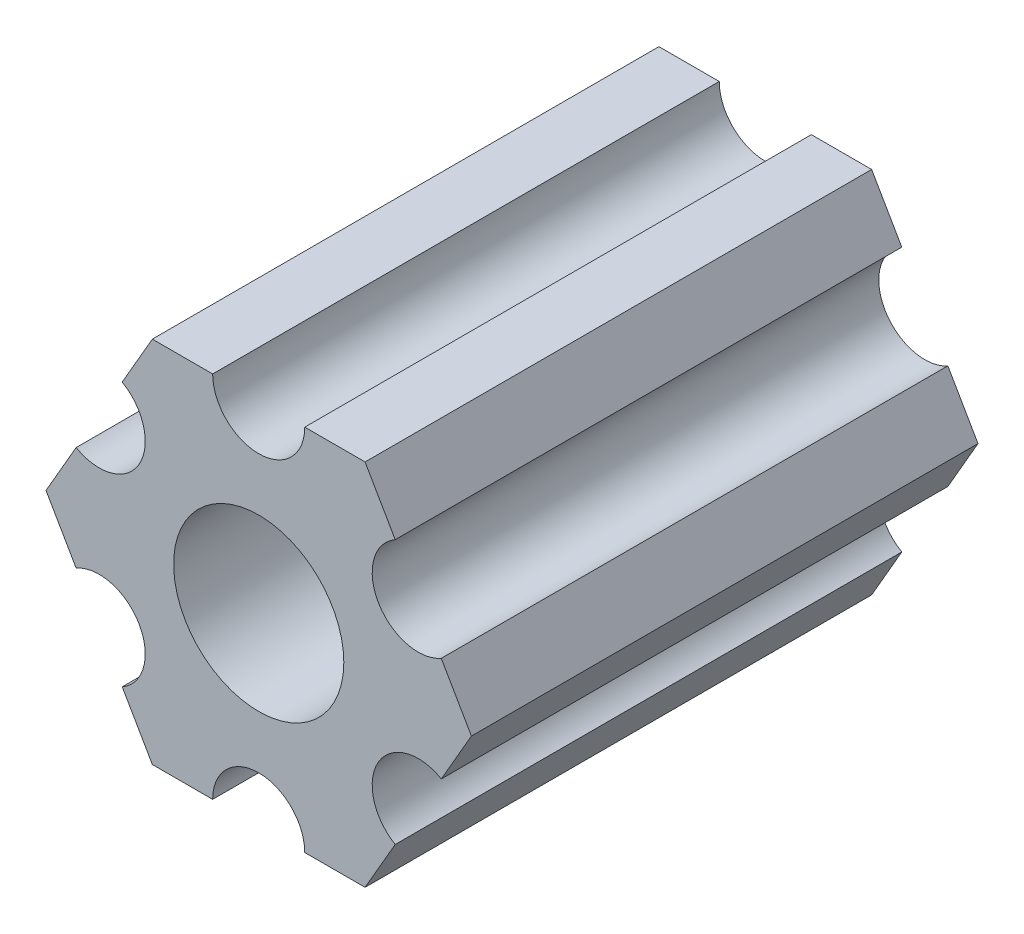
ISO-10303-21;
HEADER;
FILE_DESCRIPTION(('STEP AP214'),'2;1');
FILE_NAME('part.step','',(''),(''),'','','');
FILE_SCHEMA(('AUTOMOTIVE_DESIGN { 1 0 10303 214 1 1 1 1 }'));
ENDSEC;
DATA;
#1=APPLICATION_CONTEXT('core data for automotive mechanical design processes');
#2=APPLICATION_PROTOCOL_DEFINITION('international standard','automotive_design',2000,#1);
#3=PRODUCT_CONTEXT('',#1,'mechanical');
#4=PRODUCT('Part','Part','',(#3));
#5=PRODUCT_RELATED_PRODUCT_CATEGORY('part','',(#4));
#6=PRODUCT_DEFINITION_FORMATION('','',#4);
#7=PRODUCT_DEFINITION_CONTEXT('part definition',#1,'design');
#8=PRODUCT_DEFINITION('design','',#6,#7);
#9=PRODUCT_DEFINITION_SHAPE('','',#8);
#10=(LENGTH_UNIT() NAMED_UNIT(*) SI_UNIT(.MILLI.,.METRE.));
#11=(NAMED_UNIT(*) PLANE_ANGLE_UNIT() SI_UNIT($,.RADIAN.));
#12=(NAMED_UNIT(*) SI_UNIT($,.STERADIAN.) SOLID_ANGLE_UNIT());
#13=UNCERTAINTY_MEASURE_WITH_UNIT(LENGTH_MEASURE(1.E-05),#10,'distance_accuracy_value','');
#14=(GEOMETRIC_REPRESENTATION_CONTEXT(3) GLOBAL_UNCERTAINTY_ASSIGNED_CONTEXT((#13)) GLOBAL_UNIT_ASSIGNED_CONTEXT((#10,
#11,#12)) REPRESENTATION_CONTEXT('',''));
#15=CARTESIAN_POINT('',(0.,0.,0.));
#16=DIRECTION('',(0.,0.,1.));
#17=DIRECTION('',(1.,0.,0.));
#18=AXIS2_PLACEMENT_3D('',#15,#16,#17);
#19=CARTESIAN_POINT('',(5.49926123384919,-3.17500007340606,17.4625));
#20=DIRECTION('',(0.,0.,-1.));
#21=DIRECTION('',(-1.,0.,0.));
#22=AXIS2_PLACEMENT_3D('',#19,#20,#21);
#23=CYLINDRICAL_SURFACE('',#22,1.58750000000001);
#24=CARTESIAN_POINT('',(5.49926123384919,-3.17500007340606,0.));
#25=DIRECTION('',(0.,0.,1.));
#26=DIRECTION('',(1.,0.,0.));
#27=AXIS2_PLACEMENT_3D('',#24,#25,#26);
#28=CIRCLE('',#27,1.58750000000001);
#29=CARTESIAN_POINT('',(6.29301118896201,-1.80018471898264,0.));
#30=VERTEX_POINT('',#29);
#31=CARTESIAN_POINT('',(4.70551127873637,-4.54981542782949,0.));
#32=VERTEX_POINT('',#31);
#33=EDGE_CURVE('E190',#30,#32,#28,.T.);
#34=ORIENTED_EDGE('',*,*,#33,.F.);
#35=DIRECTION('',(0.,0.,-1.));
#36=VECTOR('',#35,1.);
#37=CARTESIAN_POINT('',(6.29301118896201,-1.80018471898264,17.4625));
#38=LINE('',#37,#36);
#39=CARTESIAN_POINT('',(6.29301118896201,-1.80018471898264,17.4625));
#40=VERTEX_POINT('',#39);
#41=EDGE_CURVE('E11',#40,#30,#38,.T.);
#42=ORIENTED_EDGE('',*,*,#41,.F.);
#43=CARTESIAN_POINT('',(5.49926123384919,-3.17500007340606,17.4625));
#44=DIRECTION('',(0.,0.,1.));
#45=DIRECTION('',(1.,0.,0.));
#46=AXIS2_PLACEMENT_3D('',#43,#44,#45);
#47=CIRCLE('',#46,1.58750000000001);
#48=CARTESIAN_POINT('',(4.70551127873637,-4.54981542782949,17.4625));
#49=VERTEX_POINT('',#48);
#50=EDGE_CURVE('E241',#40,#49,#47,.T.);
#51=ORIENTED_EDGE('',*,*,#50,.T.);
#52=DIRECTION('',(0.,0.,-1.));
#53=VECTOR('',#52,1.);
#54=CARTESIAN_POINT('',(4.70551127873637,-4.54981542782949,17.4625));
#55=LINE('',#54,#53);
#56=EDGE_CURVE('E36',#49,#32,#55,.T.);
#57=ORIENTED_EDGE('',*,*,#56,.T.);
#58=EDGE_LOOP('',(#34,#42,#51,#57));
#59=FACE_BOUND('',#58,.T.);
#60=ADVANCED_FACE('F33',(#59),#23,.F.);
#61=CARTESIAN_POINT('',(7.33234824269059,0.,17.4625));
#62=DIRECTION('',(0.866025420109243,-0.499999971724609,0.));
#63=DIRECTION('',(0.499999971724609,0.866025420109243,0.));
#64=AXIS2_PLACEMENT_3D('',#61,#62,#63);
#65=PLANE('',#64);
#66=DIRECTION('',(-0.499999971724609,-0.866025420109243,0.));
#67=VECTOR('',#66,1.);
#68=CARTESIAN_POINT('',(7.33234824269059,0.,0.));
#69=LINE('',#68,#67);
#70=CARTESIAN_POINT('',(7.33234824269059,0.,0.));
#71=VERTEX_POINT('',#70);
#72=EDGE_CURVE('E239',#71,#30,#69,.T.);
#73=ORIENTED_EDGE('',*,*,#72,.F.);
#74=DIRECTION('',(0.,0.,-1.));
#75=VECTOR('',#74,1.);
#76=CARTESIAN_POINT('',(7.33234824269059,0.,17.4625));
#77=LINE('',#76,#75);
#78=CARTESIAN_POINT('',(7.33234824269059,0.,17.4625));
#79=VERTEX_POINT('',#78);
#80=EDGE_CURVE('E42',#79,#71,#77,.T.);
#81=ORIENTED_EDGE('',*,*,#80,.F.);
#82=DIRECTION('',(-0.499999971724609,-0.866025420109243,0.));
#83=VECTOR('',#82,1.);
#84=CARTESIAN_POINT('',(7.33234824269059,0.,17.4625));
#85=LINE('',#84,#83);
#86=EDGE_CURVE('E180',#79,#40,#85,.T.);
#87=ORIENTED_EDGE('',*,*,#86,.T.);
#88=ORIENTED_EDGE('',*,*,#41,.T.);
#89=EDGE_LOOP('',(#73,#81,#87,#88));
#90=FACE_BOUND('',#89,.T.);
#91=ADVANCED_FACE('F273',(#90),#65,.T.);
#92=CARTESIAN_POINT('',(6.29301118896201,1.80018471898263,17.4625));
#93=DIRECTION('',(0.866025420109242,0.49999997172461,0.));
#94=DIRECTION('',(-0.49999997172461,0.866025420109242,0.));
#95=AXIS2_PLACEMENT_3D('',#92,#93,#94);
#96=PLANE('',#95);
#97=DIRECTION('',(0.49999997172461,-0.866025420109242,0.));
#98=VECTOR('',#97,1.);
#99=CARTESIAN_POINT('',(6.29301118896201,1.80018471898263,0.));
#100=LINE('',#99,#98);
#101=CARTESIAN_POINT('',(6.29301118896201,1.80018471898263,0.));
#102=VERTEX_POINT('',#101);
#103=EDGE_CURVE('E167',#102,#71,#100,.T.);
#104=ORIENTED_EDGE('',*,*,#103,.F.);
#105=DIRECTION('',(0.,0.,-1.));
#106=VECTOR('',#105,1.);
#107=CARTESIAN_POINT('',(6.29301118896201,1.80018471898263,17.4625));
#108=LINE('',#107,#106);
#109=CARTESIAN_POINT('',(6.29301118896201,1.80018471898263,17.4625));
#110=VERTEX_POINT('',#109);
#111=EDGE_CURVE('E162',#110,#102,#108,.T.);
#112=ORIENTED_EDGE('',*,*,#111,.F.);
#113=DIRECTION('',(0.49999997172461,-0.866025420109242,0.));
#114=VECTOR('',#113,1.);
#115=CARTESIAN_POINT('',(6.29301118896201,1.80018471898263,17.4625));
#116=LINE('',#115,#114);
#117=EDGE_CURVE('E165',#110,#79,#116,.T.);
#118=ORIENTED_EDGE('',*,*,#117,.T.);
#119=ORIENTED_EDGE('',*,*,#80,.T.);
#120=EDGE_LOOP('',(#104,#112,#118,#119));
#121=FACE_BOUND('',#120,.T.);
#122=ADVANCED_FACE('F164',(#121),#96,.T.);
#123=CARTESIAN_POINT('',(5.49926123384919,3.17500007340606,17.4625));
#124=DIRECTION('',(0.,0.,-1.));
#125=DIRECTION('',(-1.,0.,0.));
#126=AXIS2_PLACEMENT_3D('',#123,#124,#125);
#127=CYLINDRICAL_SURFACE('',#126,1.5875);
#128=CARTESIAN_POINT('',(5.49926123384919,3.17500007340606,0.));
#129=DIRECTION('',(0.,0.,1.));
#130=DIRECTION('',(1.,0.,0.));
#131=AXIS2_PLACEMENT_3D('',#128,#129,#130);
#132=CIRCLE('',#131,1.5875);
#133=CARTESIAN_POINT('',(4.70551127873637,4.54981542782948,0.));
#134=VERTEX_POINT('',#133);
#135=EDGE_CURVE('E236',#134,#102,#132,.T.);
#136=ORIENTED_EDGE('',*,*,#135,.F.);
#137=DIRECTION('',(0.,0.,-1.));
#138=VECTOR('',#137,1.);
#139=CARTESIAN_POINT('',(4.70551127873637,4.54981542782948,17.4625));
#140=LINE('',#139,#138);
#141=CARTESIAN_POINT('',(4.70551127873637,4.54981542782948,17.4625));
#142=VERTEX_POINT('',#141);
#143=EDGE_CURVE('E172',#142,#134,#140,.T.);
#144=ORIENTED_EDGE('',*,*,#143,.F.);
#145=CARTESIAN_POINT('',(5.49926123384919,3.17500007340606,17.4625));
#146=DIRECTION('',(0.,0.,1.));
#147=DIRECTION('',(1.,0.,0.));
#148=AXIS2_PLACEMENT_3D('',#145,#146,#147);
#149=CIRCLE('',#148,1.5875);
#150=EDGE_CURVE('E178',#142,#110,#149,.T.);
#151=ORIENTED_EDGE('',*,*,#150,.T.);
#152=ORIENTED_EDGE('',*,*,#111,.T.);
#153=EDGE_LOOP('',(#136,#144,#151,#152));
#154=FACE_BOUND('',#153,.T.);
#155=ADVANCED_FACE('F182',(#154),#127,.F.);
#156=CARTESIAN_POINT('',(3.6661742250078,6.35000014681211,17.4625));
#157=DIRECTION('',(0.866025420109242,0.49999997172461,0.));
#158=DIRECTION('',(-0.49999997172461,0.866025420109242,0.));
#159=AXIS2_PLACEMENT_3D('',#156,#157,#158);
#160=PLANE('',#159);
#161=DIRECTION('',(0.49999997172461,-0.866025420109242,0.));
#162=VECTOR('',#161,1.);
#163=CARTESIAN_POINT('',(3.6661742250078,6.35000014681211,0.));
#164=LINE('',#163,#162);
#165=CARTESIAN_POINT('',(3.6661742250078,6.35000014681211,0.));
#166=VERTEX_POINT('',#165);
#167=EDGE_CURVE('E233',#166,#134,#164,.T.);
#168=ORIENTED_EDGE('',*,*,#167,.F.);
#169=DIRECTION('',(0.,0.,-1.));
#170=VECTOR('',#169,1.);
#171=CARTESIAN_POINT('',(3.6661742250078,6.35000014681211,17.4625));
#172=LINE('',#171,#170);
#173=CARTESIAN_POINT('',(3.6661742250078,6.35000014681211,17.4625));
#174=VERTEX_POINT('',#173);
#175=EDGE_CURVE('E245',#174,#166,#172,.T.);
#176=ORIENTED_EDGE('',*,*,#175,.F.);
#177=DIRECTION('',(0.49999997172461,-0.866025420109242,0.));
#178=VECTOR('',#177,1.);
#179=CARTESIAN_POINT('',(3.6661742250078,6.35000014681211,17.4625));
#180=LINE('',#179,#178);
#181=EDGE_CURVE('E183',#174,#142,#180,.T.);
#182=ORIENTED_EDGE('',*,*,#181,.T.);
#183=ORIENTED_EDGE('',*,*,#143,.T.);
#184=EDGE_LOOP('',(#168,#176,#182,#183));
#185=FACE_BOUND('',#184,.T.);
#186=ADVANCED_FACE('F286',(#185),#160,.T.);
#187=CARTESIAN_POINT('',(1.5875,6.35000014681211,17.4625));
#188=DIRECTION('',(0.,1.,0.));
#189=DIRECTION('',(0.,0.,1.));
#190=AXIS2_PLACEMENT_3D('',#187,#188,#189);
#191=PLANE('',#190);
#192=DIRECTION('',(1.,0.,0.));
#193=VECTOR('',#192,1.);
#194=CARTESIAN_POINT('',(1.5875,6.35000014681211,0.));
#195=LINE('',#194,#193);
#196=CARTESIAN_POINT('',(1.5875,6.35000014681211,0.));
#197=VERTEX_POINT('',#196);
#198=EDGE_CURVE('E230',#197,#166,#195,.T.);
#199=ORIENTED_EDGE('',*,*,#198,.F.);
#200=DIRECTION('',(0.,0.,-1.));
#201=VECTOR('',#200,1.);
#202=CARTESIAN_POINT('',(1.5875,6.35000014681211,17.4625));
#203=LINE('',#202,#201);
#204=CARTESIAN_POINT('',(1.5875,6.35000014681211,17.4625));
#205=VERTEX_POINT('',#204);
#206=EDGE_CURVE('E247',#205,#197,#203,.T.);
#207=ORIENTED_EDGE('',*,*,#206,.F.);
#208=DIRECTION('',(1.,0.,0.));
#209=VECTOR('',#208,1.);
#210=CARTESIAN_POINT('',(1.5875,6.35000014681211,17.4625));
#211=LINE('',#210,#209);
#212=EDGE_CURVE('E185',#205,#174,#211,.T.);
#213=ORIENTED_EDGE('',*,*,#212,.T.);
#214=ORIENTED_EDGE('',*,*,#175,.T.);
#215=EDGE_LOOP('',(#199,#207,#213,#214));
#216=FACE_BOUND('',#215,.T.);
#217=ADVANCED_FACE('F289',(#216),#191,.T.);
#218=CARTESIAN_POINT('',(0.,6.35000014681211,17.4625));
#219=DIRECTION('',(0.,0.,-1.));
#220=DIRECTION('',(-1.,0.,0.));
#221=AXIS2_PLACEMENT_3D('',#218,#219,#220);
#222=CYLINDRICAL_SURFACE('',#221,1.5875);
#223=CARTESIAN_POINT('',(0.,6.35000014681211,0.));
#224=DIRECTION('',(0.,0.,1.));
#225=DIRECTION('',(1.,0.,0.));
#226=AXIS2_PLACEMENT_3D('',#223,#224,#225);
#227=CIRCLE('',#226,1.5875);
#228=CARTESIAN_POINT('',(-1.5875,6.35000014681211,0.));
#229=VERTEX_POINT('',#228);
#230=EDGE_CURVE('E227',#229,#197,#227,.T.);
#231=ORIENTED_EDGE('',*,*,#230,.F.);
#232=DIRECTION('',(0.,0.,-1.));
#233=VECTOR('',#232,1.);
#234=CARTESIAN_POINT('',(-1.5875,6.35000014681211,17.4625));
#235=LINE('',#234,#233);
#236=CARTESIAN_POINT('',(-1.5875,6.35000014681211,17.4625));
#237=VERTEX_POINT('',#236);
#238=EDGE_CURVE('E249',#237,#229,#235,.T.);
#239=ORIENTED_EDGE('',*,*,#238,.F.);
#240=CARTESIAN_POINT('',(0.,6.35000014681211,17.4625));
#241=DIRECTION('',(0.,0.,1.));
#242=DIRECTION('',(1.,0.,0.));
#243=AXIS2_PLACEMENT_3D('',#240,#241,#242);
#244=CIRCLE('',#243,1.5875);
#245=EDGE_CURVE('E394',#237,#205,#244,.T.);
#246=ORIENTED_EDGE('',*,*,#245,.T.);
#247=ORIENTED_EDGE('',*,*,#206,.T.);
#248=EDGE_LOOP('',(#231,#239,#246,#247));
#249=FACE_BOUND('',#248,.T.);
#250=ADVANCED_FACE('F293',(#249),#222,.F.);
#251=CARTESIAN_POINT('',(-3.6661742250078,6.35000014681211,17.4625));
#252=DIRECTION('',(0.,1.,0.));
#253=DIRECTION('',(0.,0.,1.));
#254=AXIS2_PLACEMENT_3D('',#251,#252,#253);
#255=PLANE('',#254);
#256=DIRECTION('',(1.,0.,0.));
#257=VECTOR('',#256,1.);
#258=CARTESIAN_POINT('',(-3.6661742250078,6.35000014681211,0.));
#259=LINE('',#258,#257);
#260=CARTESIAN_POINT('',(-3.6661742250078,6.35000014681211,0.));
#261=VERTEX_POINT('',#260);
#262=EDGE_CURVE('E224',#261,#229,#259,.T.);
#263=ORIENTED_EDGE('',*,*,#262,.F.);
#264=DIRECTION('',(0.,0.,-1.));
#265=VECTOR('',#264,1.);
#266=CARTESIAN_POINT('',(-3.6661742250078,6.35000014681211,17.4625));
#267=LINE('',#266,#265);
#268=CARTESIAN_POINT('',(-3.6661742250078,6.35000014681211,17.4625));
#269=VERTEX_POINT('',#268);
#270=EDGE_CURVE('E251',#269,#261,#267,.T.);
#271=ORIENTED_EDGE('',*,*,#270,.F.);
#272=DIRECTION('',(1.,0.,0.));
#273=VECTOR('',#272,1.);
#274=CARTESIAN_POINT('',(-3.6661742250078,6.35000014681211,17.4625));
#275=LINE('',#274,#273);
#276=EDGE_CURVE('E391',#269,#237,#275,.T.);
#277=ORIENTED_EDGE('',*,*,#276,.T.);
#278=ORIENTED_EDGE('',*,*,#238,.T.);
#279=EDGE_LOOP('',(#263,#271,#277,#278));
#280=FACE_BOUND('',#279,.T.);
#281=ADVANCED_FACE('F297',(#280),#255,.T.);
#282=CARTESIAN_POINT('',(-4.70551127873637,4.54981542782948,17.4625));
#283=DIRECTION('',(-0.866025420109242,0.49999997172461,0.));
#284=DIRECTION('',(-0.49999997172461,-0.866025420109242,0.));
#285=AXIS2_PLACEMENT_3D('',#282,#283,#284);
#286=PLANE('',#285);
#287=DIRECTION('',(0.49999997172461,0.866025420109242,0.));
#288=VECTOR('',#287,1.);
#289=CARTESIAN_POINT('',(-4.70551127873637,4.54981542782948,0.));
#290=LINE('',#289,#288);
#291=CARTESIAN_POINT('',(-4.70551127873637,4.54981542782948,0.));
#292=VERTEX_POINT('',#291);
#293=EDGE_CURVE('E221',#292,#261,#290,.T.);
#294=ORIENTED_EDGE('',*,*,#293,.F.);
#295=DIRECTION('',(0.,0.,-1.));
#296=VECTOR('',#295,1.);
#297=CARTESIAN_POINT('',(-4.70551127873637,4.54981542782948,17.4625));
#298=LINE('',#297,#296);
#299=CARTESIAN_POINT('',(-4.70551127873637,4.54981542782948,17.4625));
#300=VERTEX_POINT('',#299);
#301=EDGE_CURVE('E253',#300,#292,#298,.T.);
#302=ORIENTED_EDGE('',*,*,#301,.F.);
#303=DIRECTION('',(0.49999997172461,0.866025420109242,0.));
#304=VECTOR('',#303,1.);
#305=CARTESIAN_POINT('',(-4.70551127873637,4.54981542782948,17.4625));
#306=LINE('',#305,#304);
#307=EDGE_CURVE('E388',#300,#269,#306,.T.);
#308=ORIENTED_EDGE('',*,*,#307,.T.);
#309=ORIENTED_EDGE('',*,*,#270,.T.);
#310=EDGE_LOOP('',(#294,#302,#308,#309));
#311=FACE_BOUND('',#310,.T.);
#312=ADVANCED_FACE('F301',(#311),#286,.T.);
#313=CARTESIAN_POINT('',(-5.49926123384919,3.17500007340605,17.4625));
#314=DIRECTION('',(0.,0.,-1.));
#315=DIRECTION('',(-1.,0.,0.));
#316=AXIS2_PLACEMENT_3D('',#313,#314,#315);
#317=CYLINDRICAL_SURFACE('',#316,1.5875);
#318=CARTESIAN_POINT('',(-5.49926123384919,3.17500007340605,0.));
#319=DIRECTION('',(0.,0.,1.));
#320=DIRECTION('',(1.,0.,0.));
#321=AXIS2_PLACEMENT_3D('',#318,#319,#320);
#322=CIRCLE('',#321,1.5875);
#323=CARTESIAN_POINT('',(-6.29301118896201,1.80018471898263,0.));
#324=VERTEX_POINT('',#323);
#325=EDGE_CURVE('E218',#324,#292,#322,.T.);
#326=ORIENTED_EDGE('',*,*,#325,.F.);
#327=DIRECTION('',(0.,0.,-1.));
#328=VECTOR('',#327,1.);
#329=CARTESIAN_POINT('',(-6.29301118896201,1.80018471898263,17.4625));
#330=LINE('',#329,#328);
#331=CARTESIAN_POINT('',(-6.29301118896201,1.80018471898263,17.4625));
#332=VERTEX_POINT('',#331);
#333=EDGE_CURVE('E255',#332,#324,#330,.T.);
#334=ORIENTED_EDGE('',*,*,#333,.F.);
#335=CARTESIAN_POINT('',(-5.49926123384919,3.17500007340605,17.4625));
#336=DIRECTION('',(0.,0.,1.));
#337=DIRECTION('',(1.,0.,0.));
#338=AXIS2_PLACEMENT_3D('',#335,#336,#337);
#339=CIRCLE('',#338,1.5875);
#340=EDGE_CURVE('E385',#332,#300,#339,.T.);
#341=ORIENTED_EDGE('',*,*,#340,.T.);
#342=ORIENTED_EDGE('',*,*,#301,.T.);
#343=EDGE_LOOP('',(#326,#334,#341,#342));
#344=FACE_BOUND('',#343,.T.);
#345=ADVANCED_FACE('F305',(#344),#317,.F.);
#346=CARTESIAN_POINT('',(-7.33234824269059,0.,17.4625));
#347=DIRECTION('',(-0.866025420109242,0.49999997172461,0.));
#348=DIRECTION('',(-0.49999997172461,-0.866025420109242,0.));
#349=AXIS2_PLACEMENT_3D('',#346,#347,#348);
#350=PLANE('',#349);
#351=DIRECTION('',(0.49999997172461,0.866025420109242,0.));
#352=VECTOR('',#351,1.);
#353=CARTESIAN_POINT('',(-7.33234824269059,0.,0.));
#354=LINE('',#353,#352);
#355=CARTESIAN_POINT('',(-7.33234824269059,0.,0.));
#356=VERTEX_POINT('',#355);
#357=EDGE_CURVE('E215',#356,#324,#354,.T.);
#358=ORIENTED_EDGE('',*,*,#357,.F.);
#359=DIRECTION('',(0.,0.,-1.));
#360=VECTOR('',#359,1.);
#361=CARTESIAN_POINT('',(-7.33234824269059,0.,17.4625));
#362=LINE('',#361,#360);
#363=CARTESIAN_POINT('',(-7.33234824269059,0.,17.4625));
#364=VERTEX_POINT('',#363);
#365=EDGE_CURVE('E257',#364,#356,#362,.T.);
#366=ORIENTED_EDGE('',*,*,#365,.F.);
#367=DIRECTION('',(0.49999997172461,0.866025420109242,0.));
#368=VECTOR('',#367,1.);
#369=CARTESIAN_POINT('',(-7.33234824269059,0.,17.4625));
#370=LINE('',#369,#368);
#371=EDGE_CURVE('E382',#364,#332,#370,.T.);
#372=ORIENTED_EDGE('',*,*,#371,.T.);
#373=ORIENTED_EDGE('',*,*,#333,.T.);
#374=EDGE_LOOP('',(#358,#366,#372,#373));
#375=FACE_BOUND('',#374,.T.);
#376=ADVANCED_FACE('F309',(#375),#350,.T.);
#377=CARTESIAN_POINT('',(-6.29301118896201,-1.80018471898264,17.4625));
#378=DIRECTION('',(-0.866025420109243,-0.499999971724609,0.));
#379=DIRECTION('',(0.499999971724609,-0.866025420109243,0.));
#380=AXIS2_PLACEMENT_3D('',#377,#378,#379);
#381=PLANE('',#380);
#382=DIRECTION('',(-0.499999971724609,0.866025420109243,0.));
#383=VECTOR('',#382,1.);
#384=CARTESIAN_POINT('',(-6.29301118896201,-1.80018471898264,0.));
#385=LINE('',#384,#383);
#386=CARTESIAN_POINT('',(-6.29301118896201,-1.80018471898264,0.));
#387=VERTEX_POINT('',#386);
#388=EDGE_CURVE('E212',#387,#356,#385,.T.);
#389=ORIENTED_EDGE('',*,*,#388,.F.);
#390=DIRECTION('',(0.,0.,-1.));
#391=VECTOR('',#390,1.);
#392=CARTESIAN_POINT('',(-6.29301118896201,-1.80018471898264,17.4625));
#393=LINE('',#392,#391);
#394=CARTESIAN_POINT('',(-6.29301118896201,-1.80018471898264,17.4625));
#395=VERTEX_POINT('',#394);
#396=EDGE_CURVE('E259',#395,#387,#393,.T.);
#397=ORIENTED_EDGE('',*,*,#396,.F.);
#398=DIRECTION('',(-0.499999971724609,0.866025420109243,0.));
#399=VECTOR('',#398,1.);
#400=CARTESIAN_POINT('',(-6.29301118896201,-1.80018471898264,17.4625));
#401=LINE('',#400,#399);
#402=EDGE_CURVE('E379',#395,#364,#401,.T.);
#403=ORIENTED_EDGE('',*,*,#402,.T.);
#404=ORIENTED_EDGE('',*,*,#365,.T.);
#405=EDGE_LOOP('',(#389,#397,#403,#404));
#406=FACE_BOUND('',#405,.T.);
#407=ADVANCED_FACE('F313',(#406),#381,.T.);
#408=CARTESIAN_POINT('',(-5.49926123384919,-3.17500007340606,17.4625));
#409=DIRECTION('',(0.,0.,-1.));
#410=DIRECTION('',(-1.,0.,0.));
#411=AXIS2_PLACEMENT_3D('',#408,#409,#410);
#412=CYLINDRICAL_SURFACE('',#411,1.58750000000001);
#413=CARTESIAN_POINT('',(-5.49926123384919,-3.17500007340606,0.));
#414=DIRECTION('',(0.,0.,1.));
#415=DIRECTION('',(1.,0.,0.));
#416=AXIS2_PLACEMENT_3D('',#413,#414,#415);
#417=CIRCLE('',#416,1.58750000000001);
#418=CARTESIAN_POINT('',(-4.70551127873637,-4.54981542782949,0.));
#419=VERTEX_POINT('',#418);
#420=EDGE_CURVE('E209',#419,#387,#417,.T.);
#421=ORIENTED_EDGE('',*,*,#420,.F.);
#422=DIRECTION('',(0.,0.,-1.));
#423=VECTOR('',#422,1.);
#424=CARTESIAN_POINT('',(-4.70551127873637,-4.54981542782949,17.4625));
#425=LINE('',#424,#423);
#426=CARTESIAN_POINT('',(-4.70551127873637,-4.54981542782949,17.4625));
#427=VERTEX_POINT('',#426);
#428=EDGE_CURVE('E261',#427,#419,#425,.T.);
#429=ORIENTED_EDGE('',*,*,#428,.F.);
#430=CARTESIAN_POINT('',(-5.49926123384919,-3.17500007340606,17.4625));
#431=DIRECTION('',(0.,0.,1.));
#432=DIRECTION('',(1.,0.,0.));
#433=AXIS2_PLACEMENT_3D('',#430,#431,#432);
#434=CIRCLE('',#433,1.58750000000001);
#435=EDGE_CURVE('E376',#427,#395,#434,.T.);
#436=ORIENTED_EDGE('',*,*,#435,.T.);
#437=ORIENTED_EDGE('',*,*,#396,.T.);
#438=EDGE_LOOP('',(#421,#429,#436,#437));
#439=FACE_BOUND('',#438,.T.);
#440=ADVANCED_FACE('F317',(#439),#412,.F.);
#441=CARTESIAN_POINT('',(-3.6661742250078,-6.35000014681213,17.4625));
#442=DIRECTION('',(-0.866025420109243,-0.499999971724609,0.));
#443=DIRECTION('',(0.499999971724609,-0.866025420109243,0.));
#444=AXIS2_PLACEMENT_3D('',#441,#442,#443);
#445=PLANE('',#444);
#446=DIRECTION('',(-0.499999971724609,0.866025420109243,0.));
#447=VECTOR('',#446,1.);
#448=CARTESIAN_POINT('',(-3.6661742250078,-6.35000014681213,0.));
#449=LINE('',#448,#447);
#450=CARTESIAN_POINT('',(-3.6661742250078,-6.35000014681213,0.));
#451=VERTEX_POINT('',#450);
#452=EDGE_CURVE('E206',#451,#419,#449,.T.);
#453=ORIENTED_EDGE('',*,*,#452,.F.);
#454=DIRECTION('',(0.,0.,-1.));
#455=VECTOR('',#454,1.);
#456=CARTESIAN_POINT('',(-3.6661742250078,-6.35000014681213,17.4625));
#457=LINE('',#456,#455);
#458=CARTESIAN_POINT('',(-3.6661742250078,-6.35000014681213,17.4625));
#459=VERTEX_POINT('',#458);
#460=EDGE_CURVE('E263',#459,#451,#457,.T.);
#461=ORIENTED_EDGE('',*,*,#460,.F.);
#462=DIRECTION('',(-0.499999971724609,0.866025420109243,0.));
#463=VECTOR('',#462,1.);
#464=CARTESIAN_POINT('',(-3.6661742250078,-6.35000014681213,17.4625));
#465=LINE('',#464,#463);
#466=EDGE_CURVE('E373',#459,#427,#465,.T.);
#467=ORIENTED_EDGE('',*,*,#466,.T.);
#468=ORIENTED_EDGE('',*,*,#428,.T.);
#469=EDGE_LOOP('',(#453,#461,#467,#468));
#470=FACE_BOUND('',#469,.T.);
#471=ADVANCED_FACE('F321',(#470),#445,.T.);
#472=CARTESIAN_POINT('',(-1.5875,-6.35000014681213,17.4625));
#473=DIRECTION('',(0.,-1.,0.));
#474=DIRECTION('',(0.,0.,-1.));
#475=AXIS2_PLACEMENT_3D('',#472,#473,#474);
#476=PLANE('',#475);
#477=DIRECTION('',(-1.,0.,0.));
#478=VECTOR('',#477,1.);
#479=CARTESIAN_POINT('',(-1.5875,-6.35000014681213,0.));
#480=LINE('',#479,#478);
#481=CARTESIAN_POINT('',(-1.5875,-6.35000014681213,0.));
#482=VERTEX_POINT('',#481);
#483=EDGE_CURVE('E203',#482,#451,#480,.T.);
#484=ORIENTED_EDGE('',*,*,#483,.F.);
#485=DIRECTION('',(0.,0.,-1.));
#486=VECTOR('',#485,1.);
#487=CARTESIAN_POINT('',(-1.5875,-6.35000014681213,17.4625));
#488=LINE('',#487,#486);
#489=CARTESIAN_POINT('',(-1.5875,-6.35000014681213,17.4625));
#490=VERTEX_POINT('',#489);
#491=EDGE_CURVE('E265',#490,#482,#488,.T.);
#492=ORIENTED_EDGE('',*,*,#491,.F.);
#493=DIRECTION('',(-1.,0.,0.));
#494=VECTOR('',#493,1.);
#495=CARTESIAN_POINT('',(-1.5875,-6.35000014681213,17.4625));
#496=LINE('',#495,#494);
#497=EDGE_CURVE('E370',#490,#459,#496,.T.);
#498=ORIENTED_EDGE('',*,*,#497,.T.);
#499=ORIENTED_EDGE('',*,*,#460,.T.);
#500=EDGE_LOOP('',(#484,#492,#498,#499));
#501=FACE_BOUND('',#500,.T.);
#502=ADVANCED_FACE('F325',(#501),#476,.T.);
#503=CARTESIAN_POINT('',(0.,-6.35000014681213,17.4625));
#504=DIRECTION('',(0.,0.,-1.));
#505=DIRECTION('',(-1.,0.,0.));
#506=AXIS2_PLACEMENT_3D('',#503,#504,#505);
#507=CYLINDRICAL_SURFACE('',#506,1.5875);
#508=CARTESIAN_POINT('',(0.,-6.35000014681213,0.));
#509=DIRECTION('',(0.,0.,1.));
#510=DIRECTION('',(1.,0.,0.));
#511=AXIS2_PLACEMENT_3D('',#508,#509,#510);
#512=CIRCLE('',#511,1.5875);
#513=CARTESIAN_POINT('',(1.5875,-6.35000014681213,0.));
#514=VERTEX_POINT('',#513);
#515=EDGE_CURVE('E200',#514,#482,#512,.T.);
#516=ORIENTED_EDGE('',*,*,#515,.F.);
#517=DIRECTION('',(0.,0.,-1.));
#518=VECTOR('',#517,1.);
#519=CARTESIAN_POINT('',(1.5875,-6.35000014681213,17.4625));
#520=LINE('',#519,#518);
#521=CARTESIAN_POINT('',(1.5875,-6.35000014681213,17.4625));
#522=VERTEX_POINT('',#521);
#523=EDGE_CURVE('E267',#522,#514,#520,.T.);
#524=ORIENTED_EDGE('',*,*,#523,.F.);
#525=CARTESIAN_POINT('',(0.,-6.35000014681213,17.4625));
#526=DIRECTION('',(0.,0.,1.));
#527=DIRECTION('',(1.,0.,0.));
#528=AXIS2_PLACEMENT_3D('',#525,#526,#527);
#529=CIRCLE('',#528,1.5875);
#530=EDGE_CURVE('E367',#522,#490,#529,.T.);
#531=ORIENTED_EDGE('',*,*,#530,.T.);
#532=ORIENTED_EDGE('',*,*,#491,.T.);
#533=EDGE_LOOP('',(#516,#524,#531,#532));
#534=FACE_BOUND('',#533,.T.);
#535=ADVANCED_FACE('F329',(#534),#507,.F.);
#536=CARTESIAN_POINT('',(3.6661742250078,-6.35000014681213,17.4625));
#537=DIRECTION('',(0.,-1.,0.));
#538=DIRECTION('',(0.,0.,-1.));
#539=AXIS2_PLACEMENT_3D('',#536,#537,#538);
#540=PLANE('',#539);
#541=DIRECTION('',(-1.,0.,0.));
#542=VECTOR('',#541,1.);
#543=CARTESIAN_POINT('',(3.6661742250078,-6.35000014681213,0.));
#544=LINE('',#543,#542);
#545=CARTESIAN_POINT('',(3.6661742250078,-6.35000014681213,0.));
#546=VERTEX_POINT('',#545);
#547=EDGE_CURVE('E197',#546,#514,#544,.T.);
#548=ORIENTED_EDGE('',*,*,#547,.F.);
#549=DIRECTION('',(0.,0.,-1.));
#550=VECTOR('',#549,1.);
#551=CARTESIAN_POINT('',(3.6661742250078,-6.35000014681213,17.4625));
#552=LINE('',#551,#550);
#553=CARTESIAN_POINT('',(3.6661742250078,-6.35000014681213,17.4625));
#554=VERTEX_POINT('',#553);
#555=EDGE_CURVE('E268',#554,#546,#552,.T.);
#556=ORIENTED_EDGE('',*,*,#555,.F.);
#557=DIRECTION('',(-1.,0.,0.));
#558=VECTOR('',#557,1.);
#559=CARTESIAN_POINT('',(3.6661742250078,-6.35000014681213,17.4625));
#560=LINE('',#559,#558);
#561=EDGE_CURVE('E364',#554,#522,#560,.T.);
#562=ORIENTED_EDGE('',*,*,#561,.T.);
#563=ORIENTED_EDGE('',*,*,#523,.T.);
#564=EDGE_LOOP('',(#548,#556,#562,#563));
#565=FACE_BOUND('',#564,.T.);
#566=ADVANCED_FACE('F333',(#565),#540,.T.);
#567=CARTESIAN_POINT('',(4.70551127873637,-4.54981542782949,17.4625));
#568=DIRECTION('',(0.866025420109243,-0.499999971724609,0.));
#569=DIRECTION('',(0.499999971724609,0.866025420109243,0.));
#570=AXIS2_PLACEMENT_3D('',#567,#568,#569);
#571=PLANE('',#570);
#572=DIRECTION('',(-0.499999971724609,-0.866025420109243,0.));
#573=VECTOR('',#572,1.);
#574=CARTESIAN_POINT('',(4.70551127873637,-4.54981542782949,0.));
#575=LINE('',#574,#573);
#576=EDGE_CURVE('E193',#32,#546,#575,.T.);
#577=ORIENTED_EDGE('',*,*,#576,.F.);
#578=ORIENTED_EDGE('',*,*,#56,.F.);
#579=DIRECTION('',(-0.499999971724609,-0.866025420109243,0.));
#580=VECTOR('',#579,1.);
#581=CARTESIAN_POINT('',(4.70551127873637,-4.54981542782949,17.4625));
#582=LINE('',#581,#580);
#583=EDGE_CURVE('E362',#49,#554,#582,.T.);
#584=ORIENTED_EDGE('',*,*,#583,.T.);
#585=ORIENTED_EDGE('',*,*,#555,.T.);
#586=EDGE_LOOP('',(#577,#578,#584,#585));
#587=FACE_BOUND('',#586,.T.);
#588=ADVANCED_FACE('F270',(#587),#571,.T.);
#589=CARTESIAN_POINT('',(5.49926123384919,-3.17500007340606,17.4625));
#590=DIRECTION('',(0.,0.,1.));
#591=DIRECTION('',(1.,0.,0.));
#592=AXIS2_PLACEMENT_3D('',#589,#590,#591);
#593=PLANE('',#592);
#594=CARTESIAN_POINT('',(0.,0.,17.4625));
#595=DIRECTION('',(0.,0.,-1.));
#596=DIRECTION('',(1.,0.,0.));
#597=AXIS2_PLACEMENT_3D('',#594,#595,#596);
#598=CIRCLE('',#597,2.9337);
#599=CARTESIAN_POINT('',(2.9337,0.,17.4625));
#600=VERTEX_POINT('',#599);
#601=EDGE_CURVE('E194',#600,#600,#598,.T.);
#602=ORIENTED_EDGE('',*,*,#601,.T.);
#603=EDGE_LOOP('',(#602));
#604=FACE_BOUND('',#603,.T.);
#605=ORIENTED_EDGE('',*,*,#50,.F.);
#606=ORIENTED_EDGE('',*,*,#86,.F.);
#607=ORIENTED_EDGE('',*,*,#117,.F.);
#608=ORIENTED_EDGE('',*,*,#150,.F.);
#609=ORIENTED_EDGE('',*,*,#181,.F.);
#610=ORIENTED_EDGE('',*,*,#212,.F.);
#611=ORIENTED_EDGE('',*,*,#245,.F.);
#612=ORIENTED_EDGE('',*,*,#276,.F.);
#613=ORIENTED_EDGE('',*,*,#307,.F.);
#614=ORIENTED_EDGE('',*,*,#340,.F.);
#615=ORIENTED_EDGE('',*,*,#371,.F.);
#616=ORIENTED_EDGE('',*,*,#402,.F.);
#617=ORIENTED_EDGE('',*,*,#435,.F.);
#618=ORIENTED_EDGE('',*,*,#466,.F.);
#619=ORIENTED_EDGE('',*,*,#497,.F.);
#620=ORIENTED_EDGE('',*,*,#530,.F.);
#621=ORIENTED_EDGE('',*,*,#561,.F.);
#622=ORIENTED_EDGE('',*,*,#583,.F.);
#623=EDGE_LOOP('',(#605,#606,#607,#608,#609,#610,#611,#612,#613,#614,#615,#616,#617,#618,#619,
#620,#621,#622));
#624=FACE_BOUND('',#623,.T.);
#625=ADVANCED_FACE('F176',(#604,#624),#593,.T.);
#626=CARTESIAN_POINT('',(5.49926123384919,-3.17500007340606,0.));
#627=DIRECTION('',(0.,0.,1.));
#628=DIRECTION('',(1.,0.,0.));
#629=AXIS2_PLACEMENT_3D('',#626,#627,#628);
#630=PLANE('',#629);
#631=CARTESIAN_POINT('',(0.,0.,0.));
#632=DIRECTION('',(0.,0.,-1.));
#633=DIRECTION('',(1.,0.,0.));
#634=AXIS2_PLACEMENT_3D('',#631,#632,#633);
#635=CIRCLE('',#634,2.9337);
#636=CARTESIAN_POINT('',(2.9337,0.,0.));
#637=VERTEX_POINT('',#636);
#638=EDGE_CURVE('E357',#637,#637,#635,.T.);
#639=ORIENTED_EDGE('',*,*,#638,.F.);
#640=EDGE_LOOP('',(#639));
#641=FACE_BOUND('',#640,.T.);
#642=ORIENTED_EDGE('',*,*,#33,.T.);
#643=ORIENTED_EDGE('',*,*,#576,.T.);
#644=ORIENTED_EDGE('',*,*,#547,.T.);
#645=ORIENTED_EDGE('',*,*,#515,.T.);
#646=ORIENTED_EDGE('',*,*,#483,.T.);
#647=ORIENTED_EDGE('',*,*,#452,.T.);
#648=ORIENTED_EDGE('',*,*,#420,.T.);
#649=ORIENTED_EDGE('',*,*,#388,.T.);
#650=ORIENTED_EDGE('',*,*,#357,.T.);
#651=ORIENTED_EDGE('',*,*,#325,.T.);
#652=ORIENTED_EDGE('',*,*,#293,.T.);
#653=ORIENTED_EDGE('',*,*,#262,.T.);
#654=ORIENTED_EDGE('',*,*,#230,.T.);
#655=ORIENTED_EDGE('',*,*,#198,.T.);
#656=ORIENTED_EDGE('',*,*,#167,.T.);
#657=ORIENTED_EDGE('',*,*,#135,.T.);
#658=ORIENTED_EDGE('',*,*,#103,.T.);
#659=ORIENTED_EDGE('',*,*,#72,.T.);
#660=EDGE_LOOP('',(#642,#643,#644,#645,#646,#647,#648,#649,#650,#651,#652,#653,#654,#655,#656,
#657,#658,#659));
#661=FACE_BOUND('',#660,.T.);
#662=ADVANCED_FACE('F272',(#641,#661),#630,.F.);
#663=CARTESIAN_POINT('',(0.,0.,17.4625));
#664=DIRECTION('',(0.,0.,-1.));
#665=DIRECTION('',(-1.,0.,0.));
#666=AXIS2_PLACEMENT_3D('',#663,#664,#665);
#667=CYLINDRICAL_SURFACE('',#666,2.9337);
#668=ORIENTED_EDGE('',*,*,#601,.F.);
#669=EDGE_LOOP('',(#668));
#670=FACE_BOUND('',#669,.T.);
#671=ORIENTED_EDGE('',*,*,#638,.T.);
#672=EDGE_LOOP('',(#671));
#673=FACE_BOUND('',#672,.T.);
#674=ADVANCED_FACE('F345',(#670,#673),#667,.F.);
#675=CLOSED_SHELL('',(#60,#91,#122,#155,#186,#217,#250,#281,#312,#345,#376,#407,#440,#471,#502,
#535,#566,#588,#625,#662,#674));
#676=MANIFOLD_SOLID_BREP('B2',#675);
#677=ADVANCED_BREP_SHAPE_REPRESENTATION('',(#18,#676),#14);
#678=SHAPE_DEFINITION_REPRESENTATION(#9,#677);
ENDSEC;
END-ISO-10303-21;
